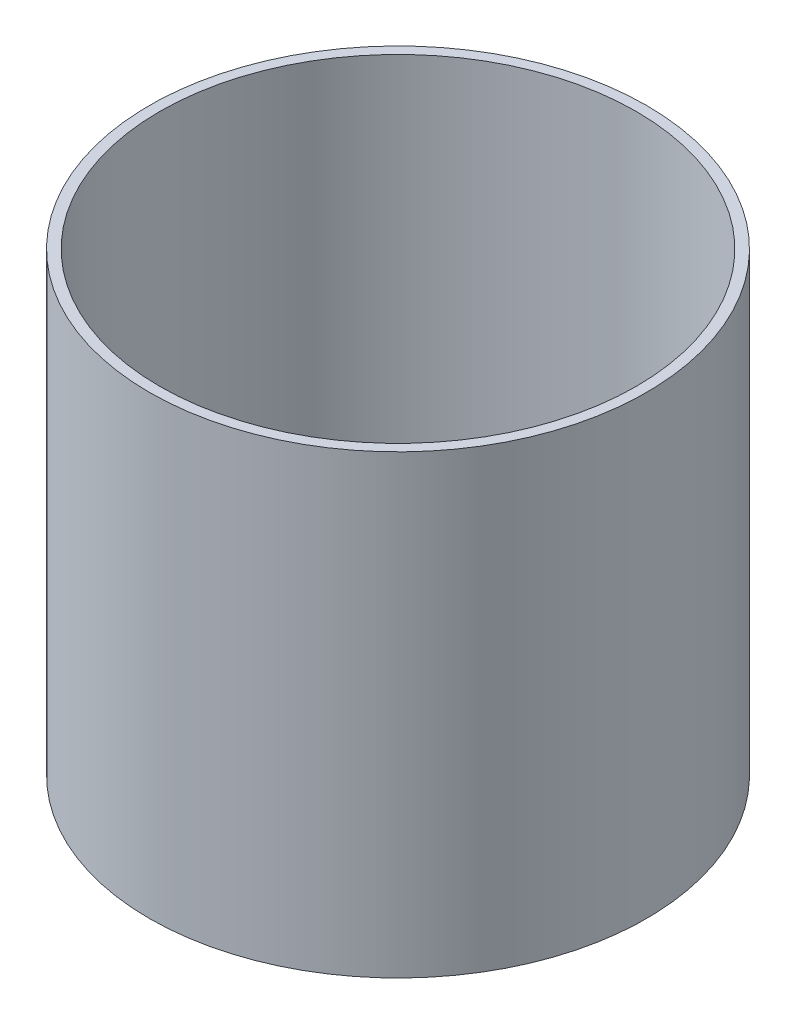
ISO-10303-21;
HEADER;
FILE_DESCRIPTION(('STEP AP214'),'2;1');
FILE_NAME('part.step','',(''),(''),'','','');
FILE_SCHEMA(('AUTOMOTIVE_DESIGN { 1 0 10303 214 1 1 1 1 }'));
ENDSEC;
DATA;
#1=APPLICATION_CONTEXT('core data for automotive mechanical design processes');
#2=APPLICATION_PROTOCOL_DEFINITION('international standard','automotive_design',2000,#1);
#3=PRODUCT_CONTEXT('',#1,'mechanical');
#4=PRODUCT('Part','Part','',(#3));
#5=PRODUCT_RELATED_PRODUCT_CATEGORY('part','',(#4));
#6=PRODUCT_DEFINITION_FORMATION('','',#4);
#7=PRODUCT_DEFINITION_CONTEXT('part definition',#1,'design');
#8=PRODUCT_DEFINITION('design','',#6,#7);
#9=PRODUCT_DEFINITION_SHAPE('','',#8);
#10=(LENGTH_UNIT() NAMED_UNIT(*) SI_UNIT(.MILLI.,.METRE.));
#11=(NAMED_UNIT(*) PLANE_ANGLE_UNIT() SI_UNIT($,.RADIAN.));
#12=(NAMED_UNIT(*) SI_UNIT($,.STERADIAN.) SOLID_ANGLE_UNIT());
#13=UNCERTAINTY_MEASURE_WITH_UNIT(LENGTH_MEASURE(1.E-05),#10,'distance_accuracy_value','');
#14=(GEOMETRIC_REPRESENTATION_CONTEXT(3) GLOBAL_UNCERTAINTY_ASSIGNED_CONTEXT((#13)) GLOBAL_UNIT_ASSIGNED_CONTEXT((#10,
#11,#12)) REPRESENTATION_CONTEXT('',''));
#15=CARTESIAN_POINT('',(0.,0.,0.));
#16=DIRECTION('',(0.,0.,1.));
#17=DIRECTION('',(1.,0.,0.));
#18=AXIS2_PLACEMENT_3D('',#15,#16,#17);
#19=CARTESIAN_POINT('',(0.,279.4,0.));
#20=DIRECTION('',(0.,1.,0.));
#21=DIRECTION('',(0.,0.,1.));
#22=AXIS2_PLACEMENT_3D('',#19,#20,#21);
#23=PLANE('',#22);
#24=CARTESIAN_POINT('',(0.,279.4,0.));
#25=DIRECTION('',(0.,1.,0.));
#26=DIRECTION('',(0.,0.,1.));
#27=AXIS2_PLACEMENT_3D('',#24,#25,#26);
#28=CIRCLE('',#27,152.4);
#29=CARTESIAN_POINT('',(0.,279.4,152.4));
#30=VERTEX_POINT('',#29);
#31=EDGE_CURVE('E10',#30,#30,#28,.T.);
#32=ORIENTED_EDGE('',*,*,#31,.T.);
#33=EDGE_LOOP('',(#32));
#34=FACE_BOUND('',#33,.T.);
#35=CARTESIAN_POINT('',(0.,279.4,0.));
#36=DIRECTION('',(0.,1.,0.));
#37=DIRECTION('',(0.,0.,1.));
#38=AXIS2_PLACEMENT_3D('',#35,#36,#37);
#39=CIRCLE('',#38,146.05);
#40=CARTESIAN_POINT('',(0.,279.4,146.05));
#41=VERTEX_POINT('',#40);
#42=EDGE_CURVE('E42',#41,#41,#39,.T.);
#43=ORIENTED_EDGE('',*,*,#42,.F.);
#44=EDGE_LOOP('',(#43));
#45=FACE_BOUND('',#44,.T.);
#46=ADVANCED_FACE('F31',(#34,#45),#23,.T.);
#47=CARTESIAN_POINT('',(0.,0.,0.));
#48=DIRECTION('',(0.,1.,0.));
#49=DIRECTION('',(0.,0.,1.));
#50=AXIS2_PLACEMENT_3D('',#47,#48,#49);
#51=PLANE('',#50);
#52=CARTESIAN_POINT('',(0.,0.,0.));
#53=DIRECTION('',(0.,1.,0.));
#54=DIRECTION('',(0.,0.,1.));
#55=AXIS2_PLACEMENT_3D('',#52,#53,#54);
#56=CIRCLE('',#55,152.4);
#57=CARTESIAN_POINT('',(0.,0.,152.4));
#58=VERTEX_POINT('',#57);
#59=EDGE_CURVE('E35',#58,#58,#56,.T.);
#60=ORIENTED_EDGE('',*,*,#59,.F.);
#61=EDGE_LOOP('',(#60));
#62=FACE_BOUND('',#61,.T.);
#63=CARTESIAN_POINT('',(0.,0.,0.));
#64=DIRECTION('',(0.,1.,0.));
#65=DIRECTION('',(0.,0.,1.));
#66=AXIS2_PLACEMENT_3D('',#63,#64,#65);
#67=CIRCLE('',#66,146.05);
#68=CARTESIAN_POINT('',(0.,0.,146.05));
#69=VERTEX_POINT('',#68);
#70=EDGE_CURVE('E44',#69,#69,#67,.T.);
#71=ORIENTED_EDGE('',*,*,#70,.T.);
#72=EDGE_LOOP('',(#71));
#73=FACE_BOUND('',#72,.T.);
#74=ADVANCED_FACE('F54',(#62,#73),#51,.F.);
#75=CARTESIAN_POINT('',(0.,279.4,0.));
#76=DIRECTION('',(0.,-1.,0.));
#77=DIRECTION('',(0.,0.,-1.));
#78=AXIS2_PLACEMENT_3D('',#75,#76,#77);
#79=CYLINDRICAL_SURFACE('',#78,152.4);
#80=ORIENTED_EDGE('',*,*,#31,.F.);
#81=EDGE_LOOP('',(#80));
#82=FACE_BOUND('',#81,.T.);
#83=ORIENTED_EDGE('',*,*,#59,.T.);
#84=EDGE_LOOP('',(#83));
#85=FACE_BOUND('',#84,.T.);
#86=ADVANCED_FACE('F33',(#82,#85),#79,.T.);
#87=CARTESIAN_POINT('',(0.,279.4,0.));
#88=DIRECTION('',(0.,-1.,0.));
#89=DIRECTION('',(0.,0.,-1.));
#90=AXIS2_PLACEMENT_3D('',#87,#88,#89);
#91=CYLINDRICAL_SURFACE('',#90,146.05);
#92=ORIENTED_EDGE('',*,*,#42,.T.);
#93=EDGE_LOOP('',(#92));
#94=FACE_BOUND('',#93,.T.);
#95=ORIENTED_EDGE('',*,*,#70,.F.);
#96=EDGE_LOOP('',(#95));
#97=FACE_BOUND('',#96,.T.);
#98=ADVANCED_FACE('F50',(#94,#97),#91,.F.);
#99=CLOSED_SHELL('',(#46,#74,#86,#98));
#100=MANIFOLD_SOLID_BREP('B2',#99);
#101=ADVANCED_BREP_SHAPE_REPRESENTATION('',(#18,#100),#14);
#102=SHAPE_DEFINITION_REPRESENTATION(#9,#101);
ENDSEC;
END-ISO-10303-21;
